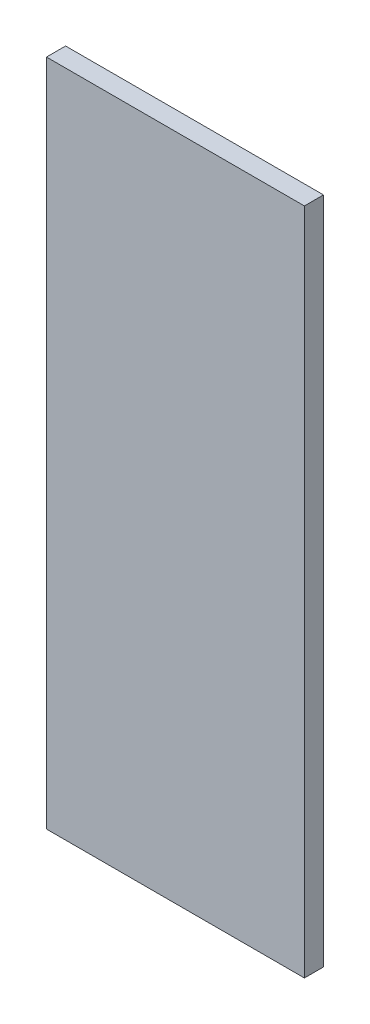
ISO-10303-21;
HEADER;
FILE_DESCRIPTION(('STEP AP214'),'2;1');
FILE_NAME('part.step','',(''),(''),'','','');
FILE_SCHEMA(('AUTOMOTIVE_DESIGN { 1 0 10303 214 1 1 1 1 }'));
ENDSEC;
DATA;
#1=APPLICATION_CONTEXT('core data for automotive mechanical design processes');
#2=APPLICATION_PROTOCOL_DEFINITION('international standard','automotive_design',2000,#1);
#3=PRODUCT_CONTEXT('',#1,'mechanical');
#4=PRODUCT('Part','Part','',(#3));
#5=PRODUCT_RELATED_PRODUCT_CATEGORY('part','',(#4));
#6=PRODUCT_DEFINITION_FORMATION('','',#4);
#7=PRODUCT_DEFINITION_CONTEXT('part definition',#1,'design');
#8=PRODUCT_DEFINITION('design','',#6,#7);
#9=PRODUCT_DEFINITION_SHAPE('','',#8);
#10=(LENGTH_UNIT() NAMED_UNIT(*) SI_UNIT(.MILLI.,.METRE.));
#11=(NAMED_UNIT(*) PLANE_ANGLE_UNIT() SI_UNIT($,.RADIAN.));
#12=(NAMED_UNIT(*) SI_UNIT($,.STERADIAN.) SOLID_ANGLE_UNIT());
#13=UNCERTAINTY_MEASURE_WITH_UNIT(LENGTH_MEASURE(1.E-05),#10,'distance_accuracy_value','');
#14=(GEOMETRIC_REPRESENTATION_CONTEXT(3) GLOBAL_UNCERTAINTY_ASSIGNED_CONTEXT((#13)) GLOBAL_UNIT_ASSIGNED_CONTEXT((#10,
#11,#12)) REPRESENTATION_CONTEXT('',''));
#15=CARTESIAN_POINT('',(0.,0.,0.));
#16=DIRECTION('',(0.,0.,1.));
#17=DIRECTION('',(1.,0.,0.));
#18=AXIS2_PLACEMENT_3D('',#15,#16,#17);
#19=CARTESIAN_POINT('',(0.,0.,10.));
#20=DIRECTION('',(-1.,0.,0.));
#21=DIRECTION('',(0.,0.,1.));
#22=AXIS2_PLACEMENT_3D('',#19,#20,#21);
#23=PLANE('',#22);
#24=DIRECTION('',(0.,1.,0.));
#25=VECTOR('',#24,1.);
#26=CARTESIAN_POINT('',(0.,0.,0.));
#27=LINE('',#26,#25);
#28=CARTESIAN_POINT('',(0.,0.,0.));
#29=VERTEX_POINT('',#28);
#30=CARTESIAN_POINT('',(0.,350.,0.));
#31=VERTEX_POINT('',#30);
#32=EDGE_CURVE('E111',#29,#31,#27,.T.);
#33=ORIENTED_EDGE('',*,*,#32,.T.);
#34=DIRECTION('',(0.,0.,-1.));
#35=VECTOR('',#34,1.);
#36=CARTESIAN_POINT('',(0.,350.,10.));
#37=LINE('',#36,#35);
#38=CARTESIAN_POINT('',(0.,350.,10.));
#39=VERTEX_POINT('',#38);
#40=EDGE_CURVE('E11',#39,#31,#37,.T.);
#41=ORIENTED_EDGE('',*,*,#40,.F.);
#42=DIRECTION('',(0.,1.,0.));
#43=VECTOR('',#42,1.);
#44=CARTESIAN_POINT('',(0.,0.,10.));
#45=LINE('',#44,#43);
#46=CARTESIAN_POINT('',(0.,0.,10.));
#47=VERTEX_POINT('',#46);
#48=EDGE_CURVE('E95',#47,#39,#45,.T.);
#49=ORIENTED_EDGE('',*,*,#48,.F.);
#50=DIRECTION('',(0.,0.,-1.));
#51=VECTOR('',#50,1.);
#52=CARTESIAN_POINT('',(0.,0.,10.));
#53=LINE('',#52,#51);
#54=EDGE_CURVE('E107',#47,#29,#53,.T.);
#55=ORIENTED_EDGE('',*,*,#54,.T.);
#56=EDGE_LOOP('',(#33,#41,#49,#55));
#57=FACE_BOUND('',#56,.T.);
#58=ADVANCED_FACE('F43',(#57),#23,.F.);
#59=CARTESIAN_POINT('',(0.,350.,10.));
#60=DIRECTION('',(0.,-1.,0.));
#61=DIRECTION('',(1.,0.,0.));
#62=AXIS2_PLACEMENT_3D('',#59,#60,#61);
#63=PLANE('',#62);
#64=DIRECTION('',(-1.,0.,0.));
#65=VECTOR('',#64,1.);
#66=CARTESIAN_POINT('',(0.,350.,0.));
#67=LINE('',#66,#65);
#68=CARTESIAN_POINT('',(-135.,350.,0.));
#69=VERTEX_POINT('',#68);
#70=EDGE_CURVE('E100',#31,#69,#67,.T.);
#71=ORIENTED_EDGE('',*,*,#70,.T.);
#72=DIRECTION('',(0.,0.,-1.));
#73=VECTOR('',#72,1.);
#74=CARTESIAN_POINT('',(-135.,350.,10.));
#75=LINE('',#74,#73);
#76=CARTESIAN_POINT('',(-135.,350.,10.));
#77=VERTEX_POINT('',#76);
#78=EDGE_CURVE('E52',#77,#69,#75,.T.);
#79=ORIENTED_EDGE('',*,*,#78,.F.);
#80=DIRECTION('',(-1.,0.,0.));
#81=VECTOR('',#80,1.);
#82=CARTESIAN_POINT('',(0.,350.,10.));
#83=LINE('',#82,#81);
#84=EDGE_CURVE('E90',#39,#77,#83,.T.);
#85=ORIENTED_EDGE('',*,*,#84,.F.);
#86=ORIENTED_EDGE('',*,*,#40,.T.);
#87=EDGE_LOOP('',(#71,#79,#85,#86));
#88=FACE_BOUND('',#87,.T.);
#89=ADVANCED_FACE('F99',(#88),#63,.F.);
#90=CARTESIAN_POINT('',(-135.,0.,10.));
#91=DIRECTION('',(1.,0.,0.));
#92=DIRECTION('',(0.,1.,0.));
#93=AXIS2_PLACEMENT_3D('',#90,#91,#92);
#94=PLANE('',#93);
#95=DIRECTION('',(0.,-1.,0.));
#96=VECTOR('',#95,1.);
#97=CARTESIAN_POINT('',(-135.,0.,0.));
#98=LINE('',#97,#96);
#99=CARTESIAN_POINT('',(-135.,0.,0.));
#100=VERTEX_POINT('',#99);
#101=EDGE_CURVE('E77',#69,#100,#98,.T.);
#102=ORIENTED_EDGE('',*,*,#101,.T.);
#103=DIRECTION('',(0.,0.,-1.));
#104=VECTOR('',#103,1.);
#105=CARTESIAN_POINT('',(-135.,0.,10.));
#106=LINE('',#105,#104);
#107=CARTESIAN_POINT('',(-135.,0.,10.));
#108=VERTEX_POINT('',#107);
#109=EDGE_CURVE('E102',#108,#100,#106,.T.);
#110=ORIENTED_EDGE('',*,*,#109,.F.);
#111=DIRECTION('',(0.,-1.,0.));
#112=VECTOR('',#111,1.);
#113=CARTESIAN_POINT('',(-135.,0.,10.));
#114=LINE('',#113,#112);
#115=EDGE_CURVE('E93',#77,#108,#114,.T.);
#116=ORIENTED_EDGE('',*,*,#115,.F.);
#117=ORIENTED_EDGE('',*,*,#78,.T.);
#118=EDGE_LOOP('',(#102,#110,#116,#117));
#119=FACE_BOUND('',#118,.T.);
#120=ADVANCED_FACE('F103',(#119),#94,.F.);
#121=CARTESIAN_POINT('',(0.,0.,10.));
#122=DIRECTION('',(0.,1.,0.));
#123=DIRECTION('',(-1.,0.,0.));
#124=AXIS2_PLACEMENT_3D('',#121,#122,#123);
#125=PLANE('',#124);
#126=DIRECTION('',(1.,0.,0.));
#127=VECTOR('',#126,1.);
#128=CARTESIAN_POINT('',(0.,0.,0.));
#129=LINE('',#128,#127);
#130=EDGE_CURVE('E83',#100,#29,#129,.T.);
#131=ORIENTED_EDGE('',*,*,#130,.T.);
#132=ORIENTED_EDGE('',*,*,#54,.F.);
#133=DIRECTION('',(1.,0.,0.));
#134=VECTOR('',#133,1.);
#135=CARTESIAN_POINT('',(0.,0.,10.));
#136=LINE('',#135,#134);
#137=EDGE_CURVE('E60',#108,#47,#136,.T.);
#138=ORIENTED_EDGE('',*,*,#137,.F.);
#139=ORIENTED_EDGE('',*,*,#109,.T.);
#140=EDGE_LOOP('',(#131,#132,#138,#139));
#141=FACE_BOUND('',#140,.T.);
#142=ADVANCED_FACE('F124',(#141),#125,.F.);
#143=CARTESIAN_POINT('',(0.,0.,10.));
#144=DIRECTION('',(0.,0.,1.));
#145=DIRECTION('',(1.,0.,0.));
#146=AXIS2_PLACEMENT_3D('',#143,#144,#145);
#147=PLANE('',#146);
#148=ORIENTED_EDGE('',*,*,#48,.T.);
#149=ORIENTED_EDGE('',*,*,#84,.T.);
#150=ORIENTED_EDGE('',*,*,#115,.T.);
#151=ORIENTED_EDGE('',*,*,#137,.T.);
#152=EDGE_LOOP('',(#148,#149,#150,#151));
#153=FACE_BOUND('',#152,.T.);
#154=ADVANCED_FACE('F91',(#153),#147,.T.);
#155=CARTESIAN_POINT('',(0.,0.,0.));
#156=DIRECTION('',(0.,0.,1.));
#157=DIRECTION('',(1.,0.,0.));
#158=AXIS2_PLACEMENT_3D('',#155,#156,#157);
#159=PLANE('',#158);
#160=ORIENTED_EDGE('',*,*,#32,.F.);
#161=ORIENTED_EDGE('',*,*,#130,.F.);
#162=ORIENTED_EDGE('',*,*,#101,.F.);
#163=ORIENTED_EDGE('',*,*,#70,.F.);
#164=EDGE_LOOP('',(#160,#161,#162,#163));
#165=FACE_BOUND('',#164,.T.);
#166=ADVANCED_FACE('F127',(#165),#159,.F.);
#167=CLOSED_SHELL('',(#58,#89,#120,#142,#154,#166));
#168=MANIFOLD_SOLID_BREP('B2',#167);
#169=ADVANCED_BREP_SHAPE_REPRESENTATION('',(#18,#168),#14);
#170=SHAPE_DEFINITION_REPRESENTATION(#9,#169);
ENDSEC;
END-ISO-10303-21;
